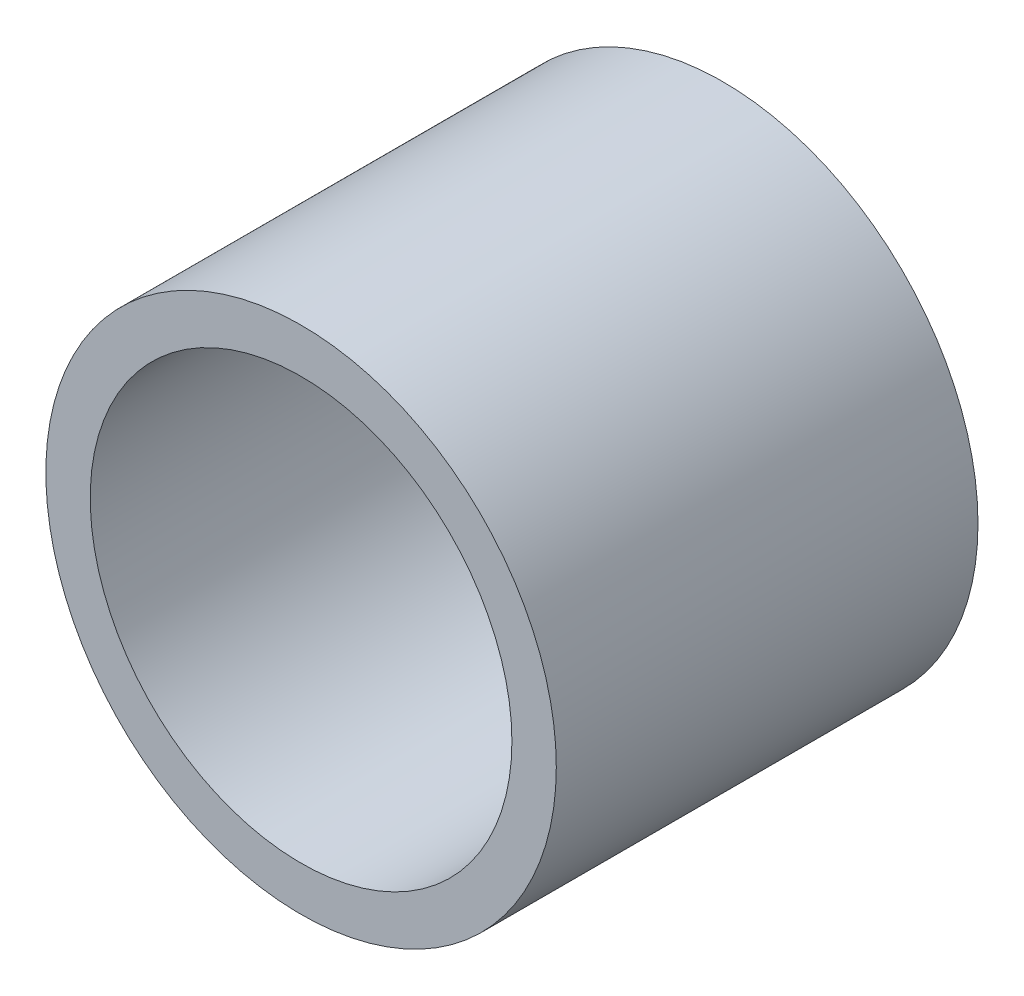
ISO-10303-21;
HEADER;
FILE_DESCRIPTION(('STEP AP214'),'2;1');
FILE_NAME('part.step','',(''),(''),'','','');
FILE_SCHEMA(('AUTOMOTIVE_DESIGN { 1 0 10303 214 1 1 1 1 }'));
ENDSEC;
DATA;
#1=APPLICATION_CONTEXT('core data for automotive mechanical design processes');
#2=APPLICATION_PROTOCOL_DEFINITION('international standard','automotive_design',2000,#1);
#3=PRODUCT_CONTEXT('',#1,'mechanical');
#4=PRODUCT('Part','Part','',(#3));
#5=PRODUCT_RELATED_PRODUCT_CATEGORY('part','',(#4));
#6=PRODUCT_DEFINITION_FORMATION('','',#4);
#7=PRODUCT_DEFINITION_CONTEXT('part definition',#1,'design');
#8=PRODUCT_DEFINITION('design','',#6,#7);
#9=PRODUCT_DEFINITION_SHAPE('','',#8);
#10=(LENGTH_UNIT() NAMED_UNIT(*) SI_UNIT(.MILLI.,.METRE.));
#11=(NAMED_UNIT(*) PLANE_ANGLE_UNIT() SI_UNIT($,.RADIAN.));
#12=(NAMED_UNIT(*) SI_UNIT($,.STERADIAN.) SOLID_ANGLE_UNIT());
#13=UNCERTAINTY_MEASURE_WITH_UNIT(LENGTH_MEASURE(1.E-05),#10,'distance_accuracy_value','');
#14=(GEOMETRIC_REPRESENTATION_CONTEXT(3) GLOBAL_UNCERTAINTY_ASSIGNED_CONTEXT((#13)) GLOBAL_UNIT_ASSIGNED_CONTEXT((#10,
#11,#12)) REPRESENTATION_CONTEXT('',''));
#15=CARTESIAN_POINT('',(0.,0.,0.));
#16=DIRECTION('',(0.,0.,1.));
#17=DIRECTION('',(1.,0.,0.));
#18=AXIS2_PLACEMENT_3D('',#15,#16,#17);
#19=CARTESIAN_POINT('',(0.,0.,-19.));
#20=DIRECTION('',(0.,0.,1.));
#21=DIRECTION('',(1.,0.,0.));
#22=AXIS2_PLACEMENT_3D('',#19,#20,#21);
#23=CYLINDRICAL_SURFACE('',#22,11.5);
#24=CARTESIAN_POINT('',(0.,0.,-19.));
#25=DIRECTION('',(0.,0.,1.));
#26=DIRECTION('',(1.,0.,0.));
#27=AXIS2_PLACEMENT_3D('',#24,#25,#26);
#28=CIRCLE('',#27,11.5);
#29=CARTESIAN_POINT('',(11.5,0.,-19.));
#30=VERTEX_POINT('',#29);
#31=EDGE_CURVE('E10',#30,#30,#28,.T.);
#32=ORIENTED_EDGE('',*,*,#31,.T.);
#33=EDGE_LOOP('',(#32));
#34=FACE_BOUND('',#33,.T.);
#35=CARTESIAN_POINT('',(0.,0.,0.));
#36=DIRECTION('',(0.,0.,1.));
#37=DIRECTION('',(1.,0.,0.));
#38=AXIS2_PLACEMENT_3D('',#35,#36,#37);
#39=CIRCLE('',#38,11.5);
#40=CARTESIAN_POINT('',(11.5,0.,0.));
#41=VERTEX_POINT('',#40);
#42=EDGE_CURVE('E31',#41,#41,#39,.T.);
#43=ORIENTED_EDGE('',*,*,#42,.F.);
#44=EDGE_LOOP('',(#43));
#45=FACE_BOUND('',#44,.T.);
#46=ADVANCED_FACE('F28',(#34,#45),#23,.T.);
#47=CARTESIAN_POINT('',(0.,0.,-19.));
#48=DIRECTION('',(0.,0.,1.));
#49=DIRECTION('',(1.,0.,0.));
#50=AXIS2_PLACEMENT_3D('',#47,#48,#49);
#51=PLANE('',#50);
#52=CARTESIAN_POINT('',(0.,0.,-19.));
#53=DIRECTION('',(0.,0.,1.));
#54=DIRECTION('',(1.,0.,0.));
#55=AXIS2_PLACEMENT_3D('',#52,#53,#54);
#56=CIRCLE('',#55,9.49999999999943);
#57=CARTESIAN_POINT('',(9.49999999999946,0.,-19.));
#58=VERTEX_POINT('',#57);
#59=EDGE_CURVE('E38',#58,#58,#56,.T.);
#60=ORIENTED_EDGE('',*,*,#59,.T.);
#61=EDGE_LOOP('',(#60));
#62=FACE_BOUND('',#61,.T.);
#63=ORIENTED_EDGE('',*,*,#31,.F.);
#64=EDGE_LOOP('',(#63));
#65=FACE_BOUND('',#64,.T.);
#66=ADVANCED_FACE('F46',(#62,#65),#51,.F.);
#67=CARTESIAN_POINT('',(0.,0.,0.));
#68=DIRECTION('',(0.,0.,1.));
#69=DIRECTION('',(1.,0.,0.));
#70=AXIS2_PLACEMENT_3D('',#67,#68,#69);
#71=PLANE('',#70);
#72=CARTESIAN_POINT('',(0.,0.,0.));
#73=DIRECTION('',(0.,0.,1.));
#74=DIRECTION('',(1.,0.,0.));
#75=AXIS2_PLACEMENT_3D('',#72,#73,#74);
#76=CIRCLE('',#75,9.49999999999943);
#77=CARTESIAN_POINT('',(9.49999999999946,0.,0.));
#78=VERTEX_POINT('',#77);
#79=EDGE_CURVE('E40',#78,#78,#76,.T.);
#80=ORIENTED_EDGE('',*,*,#79,.F.);
#81=EDGE_LOOP('',(#80));
#82=FACE_BOUND('',#81,.T.);
#83=ORIENTED_EDGE('',*,*,#42,.T.);
#84=EDGE_LOOP('',(#83));
#85=FACE_BOUND('',#84,.T.);
#86=ADVANCED_FACE('F52',(#82,#85),#71,.T.);
#87=CARTESIAN_POINT('',(0.,0.,-19.));
#88=DIRECTION('',(0.,0.,1.));
#89=DIRECTION('',(1.,0.,0.));
#90=AXIS2_PLACEMENT_3D('',#87,#88,#89);
#91=CYLINDRICAL_SURFACE('',#90,9.49999999999943);
#92=ORIENTED_EDGE('',*,*,#59,.F.);
#93=EDGE_LOOP('',(#92));
#94=FACE_BOUND('',#93,.T.);
#95=ORIENTED_EDGE('',*,*,#79,.T.);
#96=EDGE_LOOP('',(#95));
#97=FACE_BOUND('',#96,.T.);
#98=ADVANCED_FACE('F49',(#94,#97),#91,.F.);
#99=CLOSED_SHELL('',(#46,#66,#86,#98));
#100=MANIFOLD_SOLID_BREP('B2',#99);
#101=ADVANCED_BREP_SHAPE_REPRESENTATION('',(#18,#100),#14);
#102=SHAPE_DEFINITION_REPRESENTATION(#9,#101);
ENDSEC;
END-ISO-10303-21;
